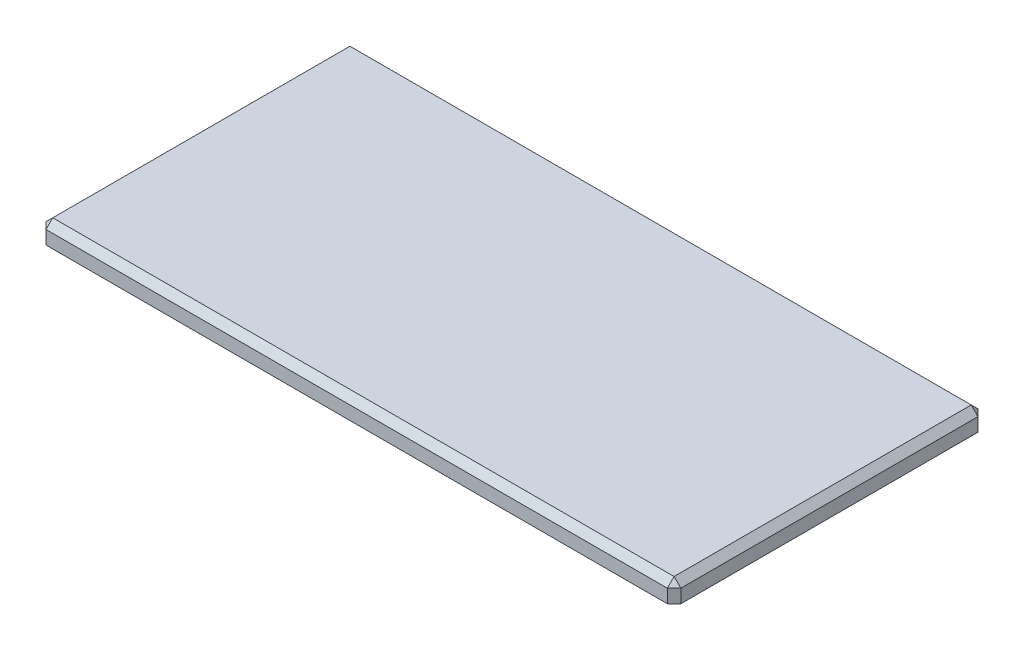
ISO-10303-21;
HEADER;
FILE_DESCRIPTION(('STEP AP214'),'2;1');
FILE_NAME('part.step','',(''),(''),'','','');
FILE_SCHEMA(('AUTOMOTIVE_DESIGN { 1 0 10303 214 1 1 1 1 }'));
ENDSEC;
DATA;
#1=APPLICATION_CONTEXT('core data for automotive mechanical design processes');
#2=APPLICATION_PROTOCOL_DEFINITION('international standard','automotive_design',2000,#1);
#3=PRODUCT_CONTEXT('',#1,'mechanical');
#4=PRODUCT('Part','Part','',(#3));
#5=PRODUCT_RELATED_PRODUCT_CATEGORY('part','',(#4));
#6=PRODUCT_DEFINITION_FORMATION('','',#4);
#7=PRODUCT_DEFINITION_CONTEXT('part definition',#1,'design');
#8=PRODUCT_DEFINITION('design','',#6,#7);
#9=PRODUCT_DEFINITION_SHAPE('','',#8);
#10=(LENGTH_UNIT() NAMED_UNIT(*) SI_UNIT(.MILLI.,.METRE.));
#11=(NAMED_UNIT(*) PLANE_ANGLE_UNIT() SI_UNIT($,.RADIAN.));
#12=(NAMED_UNIT(*) SI_UNIT($,.STERADIAN.) SOLID_ANGLE_UNIT());
#13=UNCERTAINTY_MEASURE_WITH_UNIT(LENGTH_MEASURE(1.E-05),#10,'distance_accuracy_value','');
#14=(GEOMETRIC_REPRESENTATION_CONTEXT(3) GLOBAL_UNCERTAINTY_ASSIGNED_CONTEXT((#13)) GLOBAL_UNIT_ASSIGNED_CONTEXT((#10,
#11,#12)) REPRESENTATION_CONTEXT('',''));
#15=CARTESIAN_POINT('',(0.,0.,0.));
#16=DIRECTION('',(0.,0.,1.));
#17=DIRECTION('',(1.,0.,0.));
#18=AXIS2_PLACEMENT_3D('',#15,#16,#17);
#19=CARTESIAN_POINT('',(-32.9027777777778,1.5,-13.8319444444444));
#20=DIRECTION('',(1.,0.,0.));
#21=DIRECTION('',(0.,0.,-1.));
#22=AXIS2_PLACEMENT_3D('',#19,#20,#21);
#23=PLANE('',#22);
#24=DIRECTION('',(0.,0.,-1.));
#25=VECTOR('',#24,1.);
#26=CARTESIAN_POINT('',(-32.9027777777778,0.999999999999986,-13.8319444444444));
#27=LINE('',#26,#25);
#28=CARTESIAN_POINT('',(-32.9027777777778,0.999999999999986,8.66805555555555));
#29=VERTEX_POINT('',#28);
#30=CARTESIAN_POINT('',(-32.9027777777778,0.999999999999986,-13.3319444444444));
#31=VERTEX_POINT('',#30);
#32=EDGE_CURVE('E187',#29,#31,#27,.T.);
#33=ORIENTED_EDGE('',*,*,#32,.T.);
#34=DIRECTION('',(0.,-1.,0.));
#35=VECTOR('',#34,1.);
#36=CARTESIAN_POINT('',(-32.9027777777778,1.5,-13.3319444444444));
#37=LINE('',#36,#35);
#38=CARTESIAN_POINT('',(-32.9027777777778,0.,-13.3319444444444));
#39=VERTEX_POINT('',#38);
#40=EDGE_CURVE('E193',#31,#39,#37,.T.);
#41=ORIENTED_EDGE('',*,*,#40,.T.);
#42=DIRECTION('',(0.,0.,1.));
#43=VECTOR('',#42,1.);
#44=CARTESIAN_POINT('',(-32.9027777777778,0.,-13.8319444444444));
#45=LINE('',#44,#43);
#46=CARTESIAN_POINT('',(-32.9027777777778,0.,8.66805555555555));
#47=VERTEX_POINT('',#46);
#48=EDGE_CURVE('E156',#39,#47,#45,.T.);
#49=ORIENTED_EDGE('',*,*,#48,.T.);
#50=DIRECTION('',(0.,1.,0.));
#51=VECTOR('',#50,1.);
#52=CARTESIAN_POINT('',(-32.9027777777778,1.5,8.66805555555555));
#53=LINE('',#52,#51);
#54=EDGE_CURVE('E190',#47,#29,#53,.T.);
#55=ORIENTED_EDGE('',*,*,#54,.T.);
#56=EDGE_LOOP('',(#33,#41,#49,#55));
#57=FACE_BOUND('',#56,.T.);
#58=ADVANCED_FACE('F41',(#57),#23,.F.);
#59=CARTESIAN_POINT('',(-32.9027777777778,1.5,9.16805555555556));
#60=DIRECTION('',(0.,0.,-1.));
#61=DIRECTION('',(-1.,0.,0.));
#62=AXIS2_PLACEMENT_3D('',#59,#60,#61);
#63=PLANE('',#62);
#64=DIRECTION('',(1.,0.,0.));
#65=VECTOR('',#64,1.);
#66=CARTESIAN_POINT('',(-32.9027777777778,0.,9.16805555555556));
#67=LINE('',#66,#65);
#68=CARTESIAN_POINT('',(-32.4027777777777,0.,9.16805555555556));
#69=VERTEX_POINT('',#68);
#70=CARTESIAN_POINT('',(13.5972222222222,0.,9.16805555555556));
#71=VERTEX_POINT('',#70);
#72=EDGE_CURVE('E150',#69,#71,#67,.T.);
#73=ORIENTED_EDGE('',*,*,#72,.T.);
#74=DIRECTION('',(0.,1.,0.));
#75=VECTOR('',#74,1.);
#76=CARTESIAN_POINT('',(13.5972222222222,1.5,9.16805555555556));
#77=LINE('',#76,#75);
#78=CARTESIAN_POINT('',(13.5972222222222,0.999999999999986,9.16805555555556));
#79=VERTEX_POINT('',#78);
#80=EDGE_CURVE('E124',#71,#79,#77,.T.);
#81=ORIENTED_EDGE('',*,*,#80,.T.);
#82=DIRECTION('',(-1.,0.,0.));
#83=VECTOR('',#82,1.);
#84=CARTESIAN_POINT('',(-32.9027777777778,0.999999999999986,9.16805555555556));
#85=LINE('',#84,#83);
#86=CARTESIAN_POINT('',(-32.4027777777777,0.999999999999986,9.16805555555556));
#87=VERTEX_POINT('',#86);
#88=EDGE_CURVE('E130',#79,#87,#85,.T.);
#89=ORIENTED_EDGE('',*,*,#88,.T.);
#90=DIRECTION('',(0.,-1.,0.));
#91=VECTOR('',#90,1.);
#92=CARTESIAN_POINT('',(-32.4027777777777,1.5,9.16805555555556));
#93=LINE('',#92,#91);
#94=EDGE_CURVE('E173',#87,#69,#93,.T.);
#95=ORIENTED_EDGE('',*,*,#94,.T.);
#96=EDGE_LOOP('',(#73,#81,#89,#95));
#97=FACE_BOUND('',#96,.T.);
#98=ADVANCED_FACE('F290',(#97),#63,.F.);
#99=CARTESIAN_POINT('',(14.0972222222222,1.5,-13.8319444444444));
#100=DIRECTION('',(-1.,0.,0.));
#101=DIRECTION('',(0.,0.,1.));
#102=AXIS2_PLACEMENT_3D('',#99,#100,#101);
#103=PLANE('',#102);
#104=DIRECTION('',(0.,0.,1.));
#105=VECTOR('',#104,1.);
#106=CARTESIAN_POINT('',(14.0972222222222,0.999999999999986,9.16805555555556));
#107=LINE('',#106,#105);
#108=CARTESIAN_POINT('',(14.0972222222222,0.999999999999986,-13.3319444444444));
#109=VERTEX_POINT('',#108);
#110=CARTESIAN_POINT('',(14.0972222222222,0.999999999999986,8.66805555555555));
#111=VERTEX_POINT('',#110);
#112=EDGE_CURVE('E139',#109,#111,#107,.T.);
#113=ORIENTED_EDGE('',*,*,#112,.T.);
#114=DIRECTION('',(0.,-1.,0.));
#115=VECTOR('',#114,1.);
#116=CARTESIAN_POINT('',(14.0972222222222,1.5,8.66805555555555));
#117=LINE('',#116,#115);
#118=CARTESIAN_POINT('',(14.0972222222222,0.,8.66805555555555));
#119=VERTEX_POINT('',#118);
#120=EDGE_CURVE('E123',#111,#119,#117,.T.);
#121=ORIENTED_EDGE('',*,*,#120,.T.);
#122=DIRECTION('',(0.,0.,-1.));
#123=VECTOR('',#122,1.);
#124=CARTESIAN_POINT('',(14.0972222222222,0.,-13.8319444444444));
#125=LINE('',#124,#123);
#126=CARTESIAN_POINT('',(14.0972222222222,0.,-13.3319444444444));
#127=VERTEX_POINT('',#126);
#128=EDGE_CURVE('E136',#119,#127,#125,.T.);
#129=ORIENTED_EDGE('',*,*,#128,.T.);
#130=DIRECTION('',(0.,1.,0.));
#131=VECTOR('',#130,1.);
#132=CARTESIAN_POINT('',(14.0972222222222,1.5,-13.3319444444444));
#133=LINE('',#132,#131);
#134=EDGE_CURVE('E143',#127,#109,#133,.T.);
#135=ORIENTED_EDGE('',*,*,#134,.T.);
#136=EDGE_LOOP('',(#113,#121,#129,#135));
#137=FACE_BOUND('',#136,.T.);
#138=ADVANCED_FACE('F135',(#137),#103,.F.);
#139=CARTESIAN_POINT('',(-32.9027777777778,1.5,-13.8319444444444));
#140=DIRECTION('',(0.,0.,1.));
#141=DIRECTION('',(1.,0.,0.));
#142=AXIS2_PLACEMENT_3D('',#139,#140,#141);
#143=PLANE('',#142);
#144=DIRECTION('',(1.,0.,0.));
#145=VECTOR('',#144,1.);
#146=CARTESIAN_POINT('',(14.0972222222222,0.999999999999986,-13.8319444444444));
#147=LINE('',#146,#145);
#148=CARTESIAN_POINT('',(-32.4027777777777,0.999999999999986,-13.8319444444444));
#149=VERTEX_POINT('',#148);
#150=CARTESIAN_POINT('',(13.5972222222222,0.999999999999986,-13.8319444444444));
#151=VERTEX_POINT('',#150);
#152=EDGE_CURVE('E178',#149,#151,#147,.T.);
#153=ORIENTED_EDGE('',*,*,#152,.T.);
#154=DIRECTION('',(0.,-1.,0.));
#155=VECTOR('',#154,1.);
#156=CARTESIAN_POINT('',(13.5972222222222,1.5,-13.8319444444444));
#157=LINE('',#156,#155);
#158=CARTESIAN_POINT('',(13.5972222222222,0.,-13.8319444444444));
#159=VERTEX_POINT('',#158);
#160=EDGE_CURVE('E184',#151,#159,#157,.T.);
#161=ORIENTED_EDGE('',*,*,#160,.T.);
#162=DIRECTION('',(-1.,0.,0.));
#163=VECTOR('',#162,1.);
#164=CARTESIAN_POINT('',(-32.9027777777778,0.,-13.8319444444444));
#165=LINE('',#164,#163);
#166=CARTESIAN_POINT('',(-32.4027777777777,0.,-13.8319444444444));
#167=VERTEX_POINT('',#166);
#168=EDGE_CURVE('E149',#159,#167,#165,.T.);
#169=ORIENTED_EDGE('',*,*,#168,.T.);
#170=DIRECTION('',(0.,1.,0.));
#171=VECTOR('',#170,1.);
#172=CARTESIAN_POINT('',(-32.4027777777777,1.5,-13.8319444444444));
#173=LINE('',#172,#171);
#174=EDGE_CURVE('E181',#167,#149,#173,.T.);
#175=ORIENTED_EDGE('',*,*,#174,.T.);
#176=EDGE_LOOP('',(#153,#161,#169,#175));
#177=FACE_BOUND('',#176,.T.);
#178=ADVANCED_FACE('F354',(#177),#143,.F.);
#179=CARTESIAN_POINT('',(0.,1.5,0.));
#180=DIRECTION('',(0.,1.,0.));
#181=DIRECTION('',(0.,0.,1.));
#182=AXIS2_PLACEMENT_3D('',#179,#180,#181);
#183=PLANE('',#182);
#184=DIRECTION('',(-1.,0.,0.));
#185=VECTOR('',#184,1.);
#186=CARTESIAN_POINT('',(-32.9027777777778,1.5,-13.3319444444444));
#187=LINE('',#186,#185);
#188=CARTESIAN_POINT('',(13.5972222222222,1.5,-13.3319444444444));
#189=VERTEX_POINT('',#188);
#190=CARTESIAN_POINT('',(-32.4027777777778,1.5,-13.3319444444444));
#191=VERTEX_POINT('',#190);
#192=EDGE_CURVE('E52',#189,#191,#187,.T.);
#193=ORIENTED_EDGE('',*,*,#192,.T.);
#194=DIRECTION('',(0.,0.,1.));
#195=VECTOR('',#194,1.);
#196=CARTESIAN_POINT('',(-32.4027777777778,1.5,9.16805555555556));
#197=LINE('',#196,#195);
#198=CARTESIAN_POINT('',(-32.4027777777778,1.5,8.66805555555555));
#199=VERTEX_POINT('',#198);
#200=EDGE_CURVE('E11',#191,#199,#197,.T.);
#201=ORIENTED_EDGE('',*,*,#200,.T.);
#202=DIRECTION('',(1.,0.,0.));
#203=VECTOR('',#202,1.);
#204=CARTESIAN_POINT('',(14.0972222222222,1.5,8.66805555555555));
#205=LINE('',#204,#203);
#206=CARTESIAN_POINT('',(13.5972222222222,1.5,8.66805555555555));
#207=VERTEX_POINT('',#206);
#208=EDGE_CURVE('E196',#199,#207,#205,.T.);
#209=ORIENTED_EDGE('',*,*,#208,.T.);
#210=DIRECTION('',(0.,0.,-1.));
#211=VECTOR('',#210,1.);
#212=CARTESIAN_POINT('',(13.5972222222222,1.5,-13.8319444444444));
#213=LINE('',#212,#211);
#214=EDGE_CURVE('E63',#207,#189,#213,.T.);
#215=ORIENTED_EDGE('',*,*,#214,.T.);
#216=EDGE_LOOP('',(#193,#201,#209,#215));
#217=FACE_BOUND('',#216,.T.);
#218=ADVANCED_FACE('F269',(#217),#183,.T.);
#219=CARTESIAN_POINT('',(0.,0.,0.));
#220=DIRECTION('',(0.,1.,0.));
#221=DIRECTION('',(0.,0.,1.));
#222=AXIS2_PLACEMENT_3D('',#219,#220,#221);
#223=PLANE('',#222);
#224=ORIENTED_EDGE('',*,*,#128,.F.);
#225=DIRECTION('',(0.707106781186552,0.,-0.707106781186543));
#226=VECTOR('',#225,1.);
#227=CARTESIAN_POINT('',(14.0972222222222,0.,8.66805555555555));
#228=LINE('',#227,#226);
#229=EDGE_CURVE('E119',#119,#71,#228,.F.);
#230=ORIENTED_EDGE('',*,*,#229,.T.);
#231=ORIENTED_EDGE('',*,*,#72,.F.);
#232=DIRECTION('',(0.707106781186552,0.,0.707106781186543));
#233=VECTOR('',#232,1.);
#234=CARTESIAN_POINT('',(-32.4027777777777,0.,9.16805555555556));
#235=LINE('',#234,#233);
#236=EDGE_CURVE('E142',#69,#47,#235,.F.);
#237=ORIENTED_EDGE('',*,*,#236,.T.);
#238=ORIENTED_EDGE('',*,*,#48,.F.);
#239=DIRECTION('',(-0.707106781186552,0.,0.707106781186543));
#240=VECTOR('',#239,1.);
#241=CARTESIAN_POINT('',(-32.9027777777778,0.,-13.3319444444444));
#242=LINE('',#241,#240);
#243=EDGE_CURVE('E166',#39,#167,#242,.F.);
#244=ORIENTED_EDGE('',*,*,#243,.T.);
#245=ORIENTED_EDGE('',*,*,#168,.F.);
#246=DIRECTION('',(-0.707106781186543,0.,-0.707106781186552));
#247=VECTOR('',#246,1.);
#248=CARTESIAN_POINT('',(13.5972222222222,0.,-13.8319444444444));
#249=LINE('',#248,#247);
#250=EDGE_CURVE('E131',#159,#127,#249,.F.);
#251=ORIENTED_EDGE('',*,*,#250,.T.);
#252=EDGE_LOOP('',(#224,#230,#231,#237,#238,#244,#245,#251));
#253=FACE_BOUND('',#252,.T.);
#254=ADVANCED_FACE('F145',(#253),#223,.F.);
#255=CARTESIAN_POINT('',(-32.9027777777778,1.5,-13.3319444444444));
#256=DIRECTION('',(0.707106781186543,0.,0.707106781186552));
#257=DIRECTION('',(0.,-1.,0.));
#258=AXIS2_PLACEMENT_3D('',#255,#256,#257);
#259=PLANE('',#258);
#260=DIRECTION('',(0.707106781186552,0.,-0.707106781186543));
#261=VECTOR('',#260,1.);
#262=CARTESIAN_POINT('',(-32.4027777777777,0.999999999999986,-13.8319444444444));
#263=LINE('',#262,#261);
#264=EDGE_CURVE('E46',#149,#31,#263,.F.);
#265=ORIENTED_EDGE('',*,*,#264,.F.);
#266=ORIENTED_EDGE('',*,*,#174,.F.);
#267=ORIENTED_EDGE('',*,*,#243,.F.);
#268=ORIENTED_EDGE('',*,*,#40,.F.);
#269=EDGE_LOOP('',(#265,#266,#267,#268));
#270=FACE_BOUND('',#269,.T.);
#271=ADVANCED_FACE('F44',(#270),#259,.F.);
#272=CARTESIAN_POINT('',(-32.4027777777777,0.999999999999986,-13.8319444444444));
#273=DIRECTION('',(-0.577350269189626,0.577350269189618,-0.577350269189634));
#274=DIRECTION('',(-0.707106781186552,0.,0.707106781186543));
#275=AXIS2_PLACEMENT_3D('',#272,#273,#274);
#276=PLANE('',#275);
#277=DIRECTION('',(0.,-0.707106781186552,-0.707106781186543));
#278=VECTOR('',#277,1.);
#279=CARTESIAN_POINT('',(-32.4027777777777,0.999999999999986,-13.8319444444444));
#280=LINE('',#279,#278);
#281=EDGE_CURVE('E238',#149,#191,#280,.F.);
#282=ORIENTED_EDGE('',*,*,#281,.F.);
#283=ORIENTED_EDGE('',*,*,#264,.T.);
#284=DIRECTION('',(0.707106781186543,0.707106781186552,0.));
#285=VECTOR('',#284,1.);
#286=CARTESIAN_POINT('',(-32.6527777777778,1.24999999999999,-13.3319444444444));
#287=LINE('',#286,#285);
#288=EDGE_CURVE('E240',#191,#31,#287,.F.);
#289=ORIENTED_EDGE('',*,*,#288,.F.);
#290=EDGE_LOOP('',(#282,#283,#289));
#291=FACE_BOUND('',#290,.T.);
#292=ADVANCED_FACE('F340',(#291),#276,.T.);
#293=CARTESIAN_POINT('',(-32.4027777777777,1.5,9.16805555555556));
#294=DIRECTION('',(0.707106781186543,0.,-0.707106781186552));
#295=DIRECTION('',(0.,-1.,0.));
#296=AXIS2_PLACEMENT_3D('',#293,#294,#295);
#297=PLANE('',#296);
#298=ORIENTED_EDGE('',*,*,#236,.F.);
#299=ORIENTED_EDGE('',*,*,#94,.F.);
#300=DIRECTION('',(-0.707106781186552,0.,-0.707106781186543));
#301=VECTOR('',#300,1.);
#302=CARTESIAN_POINT('',(-32.9027777777778,0.999999999999986,8.66805555555555));
#303=LINE('',#302,#301);
#304=EDGE_CURVE('E234',#29,#87,#303,.F.);
#305=ORIENTED_EDGE('',*,*,#304,.F.);
#306=ORIENTED_EDGE('',*,*,#54,.F.);
#307=EDGE_LOOP('',(#298,#299,#305,#306));
#308=FACE_BOUND('',#307,.T.);
#309=ADVANCED_FACE('F262',(#308),#297,.F.);
#310=CARTESIAN_POINT('',(-32.4027777777778,1.5,0.));
#311=DIRECTION('',(-0.707106781186552,0.707106781186543,0.));
#312=DIRECTION('',(0.,0.,-1.));
#313=AXIS2_PLACEMENT_3D('',#310,#311,#312);
#314=PLANE('',#313);
#315=ORIENTED_EDGE('',*,*,#288,.T.);
#316=ORIENTED_EDGE('',*,*,#32,.F.);
#317=DIRECTION('',(-0.707106781186543,-0.707106781186552,0.));
#318=VECTOR('',#317,1.);
#319=CARTESIAN_POINT('',(-32.9027777777778,0.999999999999986,8.66805555555555));
#320=LINE('',#319,#318);
#321=EDGE_CURVE('E230',#199,#29,#320,.T.);
#322=ORIENTED_EDGE('',*,*,#321,.F.);
#323=ORIENTED_EDGE('',*,*,#200,.F.);
#324=EDGE_LOOP('',(#315,#316,#322,#323));
#325=FACE_BOUND('',#324,.T.);
#326=ADVANCED_FACE('F268',(#325),#314,.T.);
#327=CARTESIAN_POINT('',(0.,1.5,-13.3319444444444));
#328=DIRECTION('',(0.,0.707106781186543,-0.707106781186552));
#329=DIRECTION('',(1.,0.,0.));
#330=AXIS2_PLACEMENT_3D('',#327,#328,#329);
#331=PLANE('',#330);
#332=ORIENTED_EDGE('',*,*,#281,.T.);
#333=ORIENTED_EDGE('',*,*,#192,.F.);
#334=DIRECTION('',(0.,0.707106781186552,0.707106781186543));
#335=VECTOR('',#334,1.);
#336=CARTESIAN_POINT('',(13.5972222222222,1.24999999999999,-13.5819444444444));
#337=LINE('',#336,#335);
#338=EDGE_CURVE('E226',#151,#189,#337,.T.);
#339=ORIENTED_EDGE('',*,*,#338,.F.);
#340=ORIENTED_EDGE('',*,*,#152,.F.);
#341=EDGE_LOOP('',(#332,#333,#339,#340));
#342=FACE_BOUND('',#341,.T.);
#343=ADVANCED_FACE('F329',(#342),#331,.T.);
#344=CARTESIAN_POINT('',(13.5972222222222,1.5,-13.8319444444444));
#345=DIRECTION('',(-0.707106781186552,0.,0.707106781186543));
#346=DIRECTION('',(0.,-1.,0.));
#347=AXIS2_PLACEMENT_3D('',#344,#345,#346);
#348=PLANE('',#347);
#349=ORIENTED_EDGE('',*,*,#250,.F.);
#350=ORIENTED_EDGE('',*,*,#160,.F.);
#351=DIRECTION('',(0.707106781186543,0.,0.707106781186552));
#352=VECTOR('',#351,1.);
#353=CARTESIAN_POINT('',(14.0972222222222,0.999999999999986,-13.3319444444444));
#354=LINE('',#353,#352);
#355=EDGE_CURVE('E222',#109,#151,#354,.F.);
#356=ORIENTED_EDGE('',*,*,#355,.F.);
#357=ORIENTED_EDGE('',*,*,#134,.F.);
#358=EDGE_LOOP('',(#349,#350,#356,#357));
#359=FACE_BOUND('',#358,.T.);
#360=ADVANCED_FACE('F324',(#359),#348,.F.);
#361=CARTESIAN_POINT('',(-32.9027777777778,0.999999999999986,8.66805555555555));
#362=DIRECTION('',(-0.577350269189626,0.577350269189618,0.577350269189634));
#363=DIRECTION('',(0.707106781186552,0.,0.707106781186543));
#364=AXIS2_PLACEMENT_3D('',#361,#362,#363);
#365=PLANE('',#364);
#366=ORIENTED_EDGE('',*,*,#321,.T.);
#367=ORIENTED_EDGE('',*,*,#304,.T.);
#368=DIRECTION('',(0.,0.707106781186552,-0.707106781186543));
#369=VECTOR('',#368,1.);
#370=CARTESIAN_POINT('',(-32.4027777777777,1.24999999999999,8.91805555555556));
#371=LINE('',#370,#369);
#372=EDGE_CURVE('E218',#199,#87,#371,.F.);
#373=ORIENTED_EDGE('',*,*,#372,.F.);
#374=EDGE_LOOP('',(#366,#367,#373));
#375=FACE_BOUND('',#374,.T.);
#376=ADVANCED_FACE('F267',(#375),#365,.T.);
#377=CARTESIAN_POINT('',(14.0972222222222,0.999999999999986,-13.3319444444444));
#378=DIRECTION('',(0.577350269189634,0.577350269189618,-0.577350269189626));
#379=DIRECTION('',(-0.707106781186543,0.,-0.707106781186552));
#380=AXIS2_PLACEMENT_3D('',#377,#378,#379);
#381=PLANE('',#380);
#382=ORIENTED_EDGE('',*,*,#355,.T.);
#383=ORIENTED_EDGE('',*,*,#338,.T.);
#384=DIRECTION('',(0.707106781186543,-0.707106781186552,0.));
#385=VECTOR('',#384,1.);
#386=CARTESIAN_POINT('',(14.0972222222222,0.999999999999986,-13.3319444444444));
#387=LINE('',#386,#385);
#388=EDGE_CURVE('E214',#109,#189,#387,.F.);
#389=ORIENTED_EDGE('',*,*,#388,.F.);
#390=EDGE_LOOP('',(#382,#383,#389));
#391=FACE_BOUND('',#390,.T.);
#392=ADVANCED_FACE('F315',(#391),#381,.T.);
#393=CARTESIAN_POINT('',(0.,1.5,8.66805555555555));
#394=DIRECTION('',(0.,0.707106781186543,0.707106781186552));
#395=DIRECTION('',(-1.,0.,0.));
#396=AXIS2_PLACEMENT_3D('',#393,#394,#395);
#397=PLANE('',#396);
#398=ORIENTED_EDGE('',*,*,#372,.T.);
#399=ORIENTED_EDGE('',*,*,#88,.F.);
#400=DIRECTION('',(0.,-0.707106781186552,0.707106781186543));
#401=VECTOR('',#400,1.);
#402=CARTESIAN_POINT('',(13.5972222222222,0.999999999999986,9.16805555555556));
#403=LINE('',#402,#401);
#404=EDGE_CURVE('E210',#207,#79,#403,.T.);
#405=ORIENTED_EDGE('',*,*,#404,.F.);
#406=ORIENTED_EDGE('',*,*,#208,.F.);
#407=EDGE_LOOP('',(#398,#399,#405,#406));
#408=FACE_BOUND('',#407,.T.);
#409=ADVANCED_FACE('F277',(#408),#397,.T.);
#410=CARTESIAN_POINT('',(13.5972222222222,1.5,0.));
#411=DIRECTION('',(0.707106781186552,0.707106781186543,0.));
#412=DIRECTION('',(0.,0.,1.));
#413=AXIS2_PLACEMENT_3D('',#410,#411,#412);
#414=PLANE('',#413);
#415=ORIENTED_EDGE('',*,*,#388,.T.);
#416=ORIENTED_EDGE('',*,*,#214,.F.);
#417=DIRECTION('',(-0.707106781186543,0.707106781186552,0.));
#418=VECTOR('',#417,1.);
#419=CARTESIAN_POINT('',(13.8472222222222,1.24999999999999,8.66805555555555));
#420=LINE('',#419,#418);
#421=EDGE_CURVE('E206',#111,#207,#420,.T.);
#422=ORIENTED_EDGE('',*,*,#421,.F.);
#423=ORIENTED_EDGE('',*,*,#112,.F.);
#424=EDGE_LOOP('',(#415,#416,#422,#423));
#425=FACE_BOUND('',#424,.T.);
#426=ADVANCED_FACE('F273',(#425),#414,.T.);
#427=CARTESIAN_POINT('',(13.5972222222222,0.999999999999986,9.16805555555556));
#428=DIRECTION('',(0.577350269189626,0.577350269189618,0.577350269189634));
#429=DIRECTION('',(0.707106781186552,0.,-0.707106781186543));
#430=AXIS2_PLACEMENT_3D('',#427,#428,#429);
#431=PLANE('',#430);
#432=ORIENTED_EDGE('',*,*,#421,.T.);
#433=ORIENTED_EDGE('',*,*,#404,.T.);
#434=DIRECTION('',(-0.707106781186552,0.,0.707106781186543));
#435=VECTOR('',#434,1.);
#436=CARTESIAN_POINT('',(13.5972222222222,0.999999999999986,9.16805555555556));
#437=LINE('',#436,#435);
#438=EDGE_CURVE('E203',#111,#79,#437,.T.);
#439=ORIENTED_EDGE('',*,*,#438,.F.);
#440=EDGE_LOOP('',(#432,#433,#439));
#441=FACE_BOUND('',#440,.T.);
#442=ADVANCED_FACE('F279',(#441),#431,.T.);
#443=CARTESIAN_POINT('',(14.0972222222222,1.5,8.66805555555555));
#444=DIRECTION('',(-0.707106781186543,0.,-0.707106781186552));
#445=DIRECTION('',(0.,-1.,0.));
#446=AXIS2_PLACEMENT_3D('',#443,#444,#445);
#447=PLANE('',#446);
#448=ORIENTED_EDGE('',*,*,#438,.T.);
#449=ORIENTED_EDGE('',*,*,#80,.F.);
#450=ORIENTED_EDGE('',*,*,#229,.F.);
#451=ORIENTED_EDGE('',*,*,#120,.F.);
#452=EDGE_LOOP('',(#448,#449,#450,#451));
#453=FACE_BOUND('',#452,.T.);
#454=ADVANCED_FACE('F122',(#453),#447,.F.);
#455=CLOSED_SHELL('',(#58,#98,#138,#178,#218,#254,#271,#292,#309,#326,#343,#360,#376,#392,#409,
#426,#442,#454));
#456=MANIFOLD_SOLID_BREP('B2',#455);
#457=ADVANCED_BREP_SHAPE_REPRESENTATION('',(#18,#456),#14);
#458=SHAPE_DEFINITION_REPRESENTATION(#9,#457);
ENDSEC;
END-ISO-10303-21;
